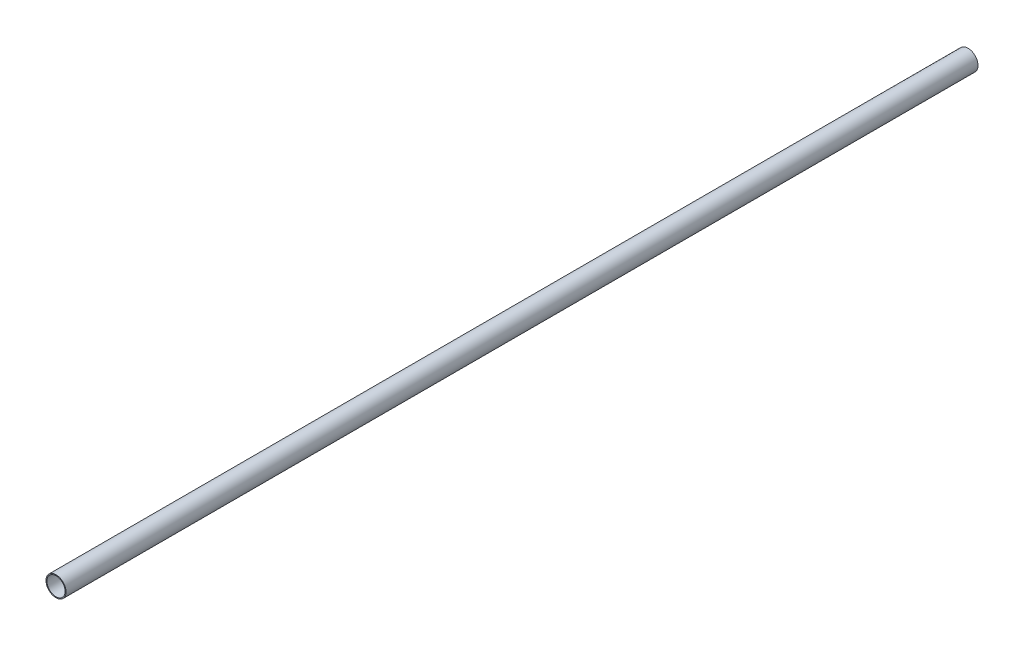
ISO-10303-21;
HEADER;
FILE_DESCRIPTION(('STEP AP214'),'2;1');
FILE_NAME('part.step','',(''),(''),'','','');
FILE_SCHEMA(('AUTOMOTIVE_DESIGN { 1 0 10303 214 1 1 1 1 }'));
ENDSEC;
DATA;
#1=APPLICATION_CONTEXT('core data for automotive mechanical design processes');
#2=APPLICATION_PROTOCOL_DEFINITION('international standard','automotive_design',2000,#1);
#3=PRODUCT_CONTEXT('',#1,'mechanical');
#4=PRODUCT('Part','Part','',(#3));
#5=PRODUCT_RELATED_PRODUCT_CATEGORY('part','',(#4));
#6=PRODUCT_DEFINITION_FORMATION('','',#4);
#7=PRODUCT_DEFINITION_CONTEXT('part definition',#1,'design');
#8=PRODUCT_DEFINITION('design','',#6,#7);
#9=PRODUCT_DEFINITION_SHAPE('','',#8);
#10=(LENGTH_UNIT() NAMED_UNIT(*) SI_UNIT(.MILLI.,.METRE.));
#11=(NAMED_UNIT(*) PLANE_ANGLE_UNIT() SI_UNIT($,.RADIAN.));
#12=(NAMED_UNIT(*) SI_UNIT($,.STERADIAN.) SOLID_ANGLE_UNIT());
#13=UNCERTAINTY_MEASURE_WITH_UNIT(LENGTH_MEASURE(1.E-05),#10,'distance_accuracy_value','');
#14=(GEOMETRIC_REPRESENTATION_CONTEXT(3) GLOBAL_UNCERTAINTY_ASSIGNED_CONTEXT((#13)) GLOBAL_UNIT_ASSIGNED_CONTEXT((#10,
#11,#12)) REPRESENTATION_CONTEXT('',''));
#15=CARTESIAN_POINT('',(0.,0.,0.));
#16=DIRECTION('',(0.,0.,1.));
#17=DIRECTION('',(1.,0.,0.));
#18=AXIS2_PLACEMENT_3D('',#15,#16,#17);
#19=CARTESIAN_POINT('',(0.,0.,1000.));
#20=DIRECTION('',(0.,0.,1.));
#21=DIRECTION('',(1.,0.,0.));
#22=AXIS2_PLACEMENT_3D('',#19,#20,#21);
#23=PLANE('',#22);
#24=CARTESIAN_POINT('',(0.,0.,1000.));
#25=DIRECTION('',(0.,0.,1.));
#26=DIRECTION('',(1.,0.,0.));
#27=AXIS2_PLACEMENT_3D('',#24,#25,#26);
#28=CIRCLE('',#27,11.);
#29=CARTESIAN_POINT('',(11.,0.,1000.));
#30=VERTEX_POINT('',#29);
#31=EDGE_CURVE('E10',#30,#30,#28,.T.);
#32=ORIENTED_EDGE('',*,*,#31,.T.);
#33=EDGE_LOOP('',(#32));
#34=FACE_BOUND('',#33,.T.);
#35=CARTESIAN_POINT('',(0.,0.,1000.));
#36=DIRECTION('',(0.,0.,1.));
#37=DIRECTION('',(1.,0.,0.));
#38=AXIS2_PLACEMENT_3D('',#35,#36,#37);
#39=CIRCLE('',#38,10.);
#40=CARTESIAN_POINT('',(10.,0.,1000.));
#41=VERTEX_POINT('',#40);
#42=EDGE_CURVE('E48',#41,#41,#39,.T.);
#43=ORIENTED_EDGE('',*,*,#42,.F.);
#44=EDGE_LOOP('',(#43));
#45=FACE_BOUND('',#44,.T.);
#46=ADVANCED_FACE('F37',(#34,#45),#23,.T.);
#47=CARTESIAN_POINT('',(0.,0.,0.));
#48=DIRECTION('',(0.,0.,1.));
#49=DIRECTION('',(1.,0.,0.));
#50=AXIS2_PLACEMENT_3D('',#47,#48,#49);
#51=PLANE('',#50);
#52=CARTESIAN_POINT('',(0.,0.,0.));
#53=DIRECTION('',(0.,0.,1.));
#54=DIRECTION('',(1.,0.,0.));
#55=AXIS2_PLACEMENT_3D('',#52,#53,#54);
#56=CIRCLE('',#55,11.);
#57=CARTESIAN_POINT('',(11.,0.,0.));
#58=VERTEX_POINT('',#57);
#59=EDGE_CURVE('E41',#58,#58,#56,.T.);
#60=ORIENTED_EDGE('',*,*,#59,.F.);
#61=EDGE_LOOP('',(#60));
#62=FACE_BOUND('',#61,.T.);
#63=CARTESIAN_POINT('',(0.,0.,0.));
#64=DIRECTION('',(0.,0.,1.));
#65=DIRECTION('',(1.,0.,0.));
#66=AXIS2_PLACEMENT_3D('',#63,#64,#65);
#67=CIRCLE('',#66,10.);
#68=CARTESIAN_POINT('',(10.,0.,0.));
#69=VERTEX_POINT('',#68);
#70=EDGE_CURVE('E50',#69,#69,#67,.T.);
#71=ORIENTED_EDGE('',*,*,#70,.T.);
#72=EDGE_LOOP('',(#71));
#73=FACE_BOUND('',#72,.T.);
#74=ADVANCED_FACE('F60',(#62,#73),#51,.F.);
#75=CARTESIAN_POINT('',(0.,0.,1000.));
#76=DIRECTION('',(0.,0.,-1.));
#77=DIRECTION('',(-1.,0.,0.));
#78=AXIS2_PLACEMENT_3D('',#75,#76,#77);
#79=CYLINDRICAL_SURFACE('',#78,11.);
#80=ORIENTED_EDGE('',*,*,#31,.F.);
#81=EDGE_LOOP('',(#80));
#82=FACE_BOUND('',#81,.T.);
#83=ORIENTED_EDGE('',*,*,#59,.T.);
#84=EDGE_LOOP('',(#83));
#85=FACE_BOUND('',#84,.T.);
#86=ADVANCED_FACE('F39',(#82,#85),#79,.T.);
#87=CARTESIAN_POINT('',(0.,0.,1000.));
#88=DIRECTION('',(0.,0.,-1.));
#89=DIRECTION('',(-1.,0.,0.));
#90=AXIS2_PLACEMENT_3D('',#87,#88,#89);
#91=CYLINDRICAL_SURFACE('',#90,10.);
#92=ORIENTED_EDGE('',*,*,#42,.T.);
#93=EDGE_LOOP('',(#92));
#94=FACE_BOUND('',#93,.T.);
#95=ORIENTED_EDGE('',*,*,#70,.F.);
#96=EDGE_LOOP('',(#95));
#97=FACE_BOUND('',#96,.T.);
#98=ADVANCED_FACE('F56',(#94,#97),#91,.F.);
#99=CLOSED_SHELL('',(#46,#74,#86,#98));
#100=MANIFOLD_SOLID_BREP('B2',#99);
#101=ADVANCED_BREP_SHAPE_REPRESENTATION('',(#18,#100),#14);
#102=SHAPE_DEFINITION_REPRESENTATION(#9,#101);
ENDSEC;
END-ISO-10303-21;
